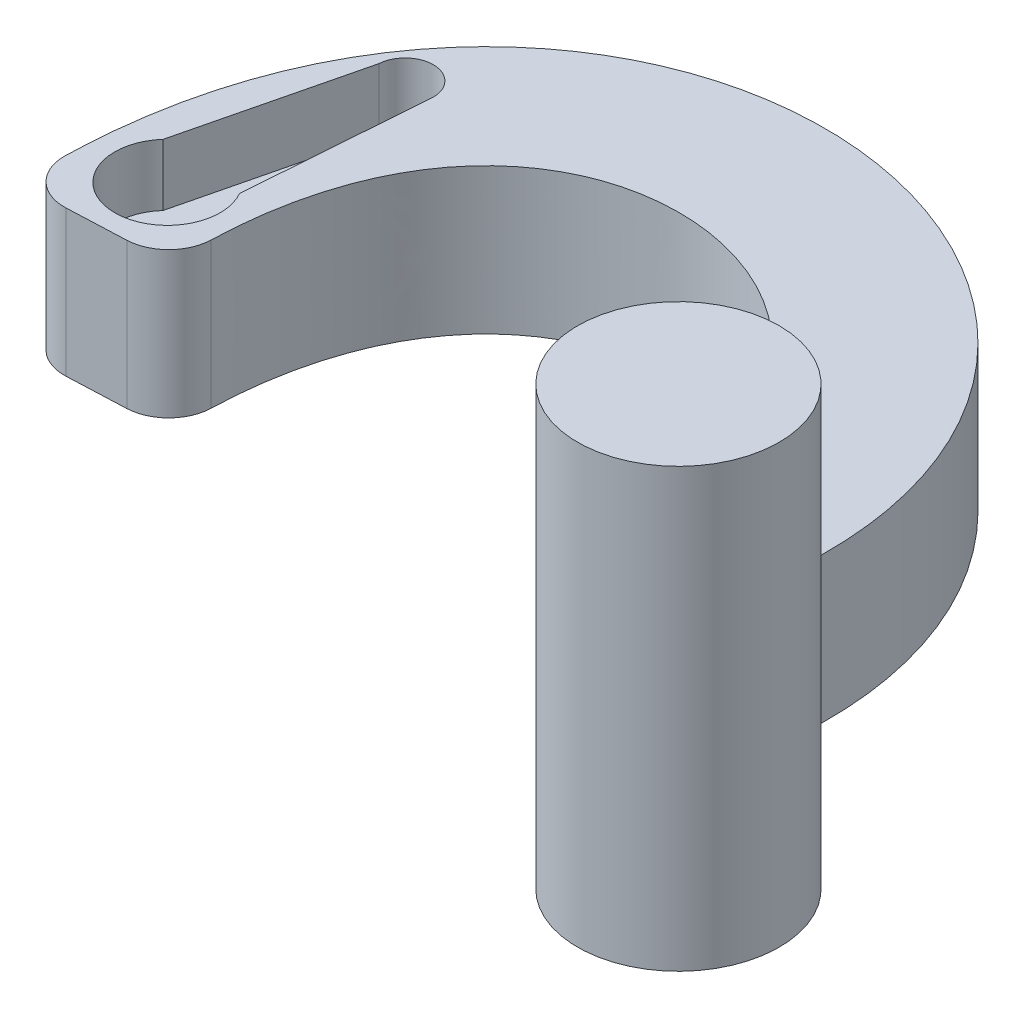
ISO-10303-21;
HEADER;
FILE_DESCRIPTION(('STEP AP214'),'2;1');
FILE_NAME('part.step','',(''),(''),'','','');
FILE_SCHEMA(('AUTOMOTIVE_DESIGN { 1 0 10303 214 1 1 1 1 }'));
ENDSEC;
DATA;
#1=APPLICATION_CONTEXT('core data for automotive mechanical design processes');
#2=APPLICATION_PROTOCOL_DEFINITION('international standard','automotive_design',2000,#1);
#3=PRODUCT_CONTEXT('',#1,'mechanical');
#4=PRODUCT('Part','Part','',(#3));
#5=PRODUCT_RELATED_PRODUCT_CATEGORY('part','',(#4));
#6=PRODUCT_DEFINITION_FORMATION('','',#4);
#7=PRODUCT_DEFINITION_CONTEXT('part definition',#1,'design');
#8=PRODUCT_DEFINITION('design','',#6,#7);
#9=PRODUCT_DEFINITION_SHAPE('','',#8);
#10=(LENGTH_UNIT() NAMED_UNIT(*) SI_UNIT(.MILLI.,.METRE.));
#11=(NAMED_UNIT(*) PLANE_ANGLE_UNIT() SI_UNIT($,.RADIAN.));
#12=(NAMED_UNIT(*) SI_UNIT($,.STERADIAN.) SOLID_ANGLE_UNIT());
#13=UNCERTAINTY_MEASURE_WITH_UNIT(LENGTH_MEASURE(1.E-05),#10,'distance_accuracy_value','');
#14=(GEOMETRIC_REPRESENTATION_CONTEXT(3) GLOBAL_UNCERTAINTY_ASSIGNED_CONTEXT((#13)) GLOBAL_UNIT_ASSIGNED_CONTEXT((#10,
#11,#12)) REPRESENTATION_CONTEXT('',''));
#15=CARTESIAN_POINT('',(0.,0.,0.));
#16=DIRECTION('',(0.,0.,1.));
#17=DIRECTION('',(1.,0.,0.));
#18=AXIS2_PLACEMENT_3D('',#15,#16,#17);
#19=CARTESIAN_POINT('',(7.64062472290803,10.,-41.6799879105812));
#20=DIRECTION('',(0.,-1.,0.));
#21=DIRECTION('',(-1.,0.,0.));
#22=AXIS2_PLACEMENT_3D('',#19,#20,#21);
#23=PLANE('',#22);
#24=CARTESIAN_POINT('',(32.7867271292734,10.,-16.1855995947889));
#25=CARTESIAN_POINT('',(32.8119604341998,10.,-18.0482852177908));
#26=CARTESIAN_POINT('',(32.6410157246207,10.,-19.8796153593314));
#27=CARTESIAN_POINT('',(31.9297026696758,10.,-23.4023587957538));
#28=CARTESIAN_POINT('',(31.389692112877,10.,-25.0928475649463));
#29=CARTESIAN_POINT('',(29.9962645290395,10.,-28.2655539081912));
#30=CARTESIAN_POINT('',(29.1436477948738,10.,-29.7475648330569));
#31=CARTESIAN_POINT('',(27.1952842098645,10.,-32.4648684794221));
#32=CARTESIAN_POINT('',(26.1000398728155,10.,-33.7005720082806));
#33=CARTESIAN_POINT('',(23.728981301755,10.,-35.9124711043768));
#34=CARTESIAN_POINT('',(22.4532211714971,10.,-36.8891668948954));
#35=CARTESIAN_POINT('',(19.767583781485,10.,-38.580346198244));
#36=CARTESIAN_POINT('',(18.3575137063876,10.,-39.295168946829));
#37=CARTESIAN_POINT('',(15.4364869316384,10.,-40.4567383093665));
#38=CARTESIAN_POINT('',(13.9252204877264,10.,-40.9036533797302));
#39=CARTESIAN_POINT('',(10.8297033006953,10.,-41.5127930644092));
#40=CARTESIAN_POINT('',(9.24503255547907,10.,-41.6749912434509));
#41=CARTESIAN_POINT('',(6.03621689033693,10.,-41.6849845777115));
#42=CARTESIAN_POINT('',(4.41160875488499,10.,-41.532400862902));
#43=CARTESIAN_POINT('',(1.17578059459176,10.,-40.8753806550135));
#44=CARTESIAN_POINT('',(-0.435544855269906,10.,-40.3701073052131));
#45=CARTESIAN_POINT('',(-3.56207624680433,10.,-38.980716277114));
#46=CARTESIAN_POINT('',(-5.07644898219667,10.,-38.0958422566122));
#47=CARTESIAN_POINT('',(-7.90552566302367,10.,-35.9576561356316));
#48=CARTESIAN_POINT('',(-9.2188575846229,10.,-34.7047592040743));
#49=CARTESIAN_POINT('',(-11.557755339762,10.,-31.887270707591));
#50=CARTESIAN_POINT('',(-12.5829006423501,10.,-30.3240851759072));
#51=CARTESIAN_POINT('',(-14.3051774786087,10.,-26.9589991969778));
#52=CARTESIAN_POINT('',(-15.0030876470042,10.,-25.1579773853439));
#53=CARTESIAN_POINT('',(-16.0720491374155,10.,-21.3665525397625));
#54=CARTESIAN_POINT('',(-16.4439595922735,10.,-19.3760411307585));
#55=CARTESIAN_POINT('',(-16.8745791436573,10.,-15.2195573111969));
#56=CARTESIAN_POINT('',(-16.9336520104563,10.,-13.0531209713478));
#57=CARTESIAN_POINT('',(-16.8393758778375,10.,-10.7937998573511));
#58=B_SPLINE_CURVE_WITH_KNOTS('',3,(#24,#25,#26,#27,#28,#29,#30,#31,#32,#33,#34,#35,#36,#37,#38,
#39,#40,#41,#42,#43,#44,#45,#46,#47,#48,#49,#50,#51,#52,#53,#54,#55,#56,#57),.UNSPECIFIED.,.F.,
.F.,(4,2,2,2,2,2,2,2,2,2,2,2,2,2,2,2,4),(0.,0.0625000000000001,0.125,0.1875,0.25,0.3125,0.375,
0.4375,0.5,0.5625,0.625000000000001,0.687500000000001,0.750000000000001,0.8125,0.875,0.9375,1.),.UNSPECIFIED.);
#59=CARTESIAN_POINT('',(32.7867271292734,10.,-16.1855995947889));
#60=VERTEX_POINT('',#59);
#61=CARTESIAN_POINT('',(-16.8685310593554,10.,-13.995153533089));
#62=VERTEX_POINT('',#61);
#63=EDGE_CURVE('E168',#60,#62,#58,.T.);
#64=ORIENTED_EDGE('',*,*,#63,.T.);
#65=CARTESIAN_POINT('',(-13.8694641005101,10.,-13.9203379173208));
#66=DIRECTION('',(0.,-1.,0.));
#67=DIRECTION('',(0.,0.,-1.));
#68=AXIS2_PLACEMENT_3D('',#65,#66,#67);
#69=CIRCLE('',#68,3.);
#70=CARTESIAN_POINT('',(-13.7443900296354,10.,-10.9229463051361));
#71=VERTEX_POINT('',#70);
#72=EDGE_CURVE('E48',#62,#71,#69,.F.);
#73=ORIENTED_EDGE('',*,*,#72,.T.);
#74=DIRECTION('',(-0.999130537394879,0.,0.0416913569582492));
#75=VECTOR('',#74,1.);
#76=CARTESIAN_POINT('',(-6.84807050388869,10.,-11.2107134269335));
#77=LINE('',#76,#75);
#78=CARTESIAN_POINT('',(-9.73794768174787,10.,-11.0901256794088));
#79=VERTEX_POINT('',#78);
#80=EDGE_CURVE('E175',#79,#71,#77,.T.);
#81=ORIENTED_EDGE('',*,*,#80,.F.);
#82=CARTESIAN_POINT('',(-9.86302175262262,10.,-14.0875172915935));
#83=DIRECTION('',(0.,-1.,0.));
#84=DIRECTION('',(0.,0.,-1.));
#85=AXIS2_PLACEMENT_3D('',#82,#83,#84);
#86=CIRCLE('',#85,3.);
#87=CARTESIAN_POINT('',(-6.86455786139781,10.,-13.9915261825208));
#88=VERTEX_POINT('',#87);
#89=EDGE_CURVE('E63',#79,#88,#86,.F.);
#90=ORIENTED_EDGE('',*,*,#89,.T.);
#91=CARTESIAN_POINT('',(22.7876445728867,10.,-16.3210544971157));
#92=CARTESIAN_POINT('',(23.0407058865293,10.,-35.0016701372489));
#93=CARTESIAN_POINT('',(-8.06194657324363,10.,-40.3011709699666));
#94=CARTESIAN_POINT('',(-6.84807050388869,10.,-11.2107134269335));
#95=B_SPLINE_CURVE_WITH_KNOTS('',3,(#91,#92,#93,#94),.UNSPECIFIED.,.F.,.F.,(4,4),(0.,1.),.UNSPECIFIED.);
#96=CARTESIAN_POINT('',(22.7876445728867,10.,-16.3210544971157));
#97=VERTEX_POINT('',#96);
#98=EDGE_CURVE('E216',#97,#88,#95,.T.);
#99=ORIENTED_EDGE('',*,*,#98,.F.);
#100=CARTESIAN_POINT('',(27.722370722819,10.,-11.4687691801821));
#101=DIRECTION('',(0.,-1.,0.));
#102=DIRECTION('',(0.,0.,-1.));
#103=AXIS2_PLACEMENT_3D('',#100,#101,#102);
#104=CIRCLE('',#103,6.92070769298594);
#105=EDGE_CURVE('E148',#97,#60,#104,.T.);
#106=ORIENTED_EDGE('',*,*,#105,.T.);
#107=EDGE_LOOP('',(#64,#73,#81,#90,#99,#106));
#108=FACE_BOUND('',#107,.T.);
#109=CARTESIAN_POINT('',(-11.7849751470021,10.,-15.9248017046449));
#110=DIRECTION('',(0.,-1.,0.));
#111=DIRECTION('',(0.,0.,-1.));
#112=AXIS2_PLACEMENT_3D('',#109,#110,#111);
#113=CIRCLE('',#112,3.6195);
#114=CARTESIAN_POINT('',(-8.64951612523121,10.,-17.7330265172153));
#115=VERTEX_POINT('',#114);
#116=CARTESIAN_POINT('',(-14.488068718964,10.,-18.3318881989816));
#117=VERTEX_POINT('',#116);
#118=EDGE_CURVE('E55',#115,#117,#113,.T.);
#119=ORIENTED_EDGE('',*,*,#118,.T.);
#120=DIRECTION('',(0.237100117350606,0.,-0.971485220861506));
#121=VECTOR('',#120,1.);
#122=CARTESIAN_POINT('',(-11.5844700898957,10.,-30.2289854546631));
#123=LINE('',#122,#121);
#124=CARTESIAN_POINT('',(-11.5844700898957,10.,-30.2289854546631));
#125=VERTEX_POINT('',#124);
#126=EDGE_CURVE('E140',#117,#125,#123,.T.);
#127=ORIENTED_EDGE('',*,*,#126,.T.);
#128=CARTESIAN_POINT('',(-9.65822953295707,10.,-30.1023305029049));
#129=DIRECTION('',(0.,-1.,0.));
#130=DIRECTION('',(0.,0.,-1.));
#131=AXIS2_PLACEMENT_3D('',#128,#129,#130);
#132=CIRCLE('',#131,1.9304);
#133=CARTESIAN_POINT('',(-7.73875692944453,10.,-29.8972230082471));
#134=VERTEX_POINT('',#133);
#135=EDGE_CURVE('E335',#125,#134,#132,.T.);
#136=ORIENTED_EDGE('',*,*,#135,.T.);
#137=DIRECTION('',(-0.0746631392163496,0.,0.997208812457231));
#138=VECTOR('',#137,1.);
#139=CARTESIAN_POINT('',(-8.64951612523121,10.,-17.7330265172153));
#140=LINE('',#139,#138);
#141=EDGE_CURVE('E136',#134,#115,#140,.T.);
#142=ORIENTED_EDGE('',*,*,#141,.T.);
#143=EDGE_LOOP('',(#119,#127,#136,#142));
#144=FACE_BOUND('',#143,.T.);
#145=ADVANCED_FACE('F39',(#108,#144),#23,.F.);
#146=DIRECTION('',(0.,-1.,0.));
#147=VECTOR('',#146,1.);
#148=SURFACE_OF_LINEAR_EXTRUSION('',#58,#147);
#149=CARTESIAN_POINT('',(32.7867271292734,0.,-16.1855995947889));
#150=CARTESIAN_POINT('',(32.8119604341998,0.,-18.0482852177908));
#151=CARTESIAN_POINT('',(32.6410157246207,0.,-19.8796153593314));
#152=CARTESIAN_POINT('',(31.9297026696758,0.,-23.4023587957538));
#153=CARTESIAN_POINT('',(31.389692112877,0.,-25.0928475649463));
#154=CARTESIAN_POINT('',(29.9962645290395,0.,-28.2655539081912));
#155=CARTESIAN_POINT('',(29.1436477948738,0.,-29.7475648330569));
#156=CARTESIAN_POINT('',(27.1952842098645,0.,-32.4648684794221));
#157=CARTESIAN_POINT('',(26.1000398728155,0.,-33.7005720082806));
#158=CARTESIAN_POINT('',(23.728981301755,0.,-35.9124711043768));
#159=CARTESIAN_POINT('',(22.4532211714971,0.,-36.8891668948954));
#160=CARTESIAN_POINT('',(19.767583781485,0.,-38.580346198244));
#161=CARTESIAN_POINT('',(18.3575137063876,0.,-39.295168946829));
#162=CARTESIAN_POINT('',(15.4364869316384,0.,-40.4567383093665));
#163=CARTESIAN_POINT('',(13.9252204877264,0.,-40.9036533797302));
#164=CARTESIAN_POINT('',(10.8297033006953,0.,-41.5127930644092));
#165=CARTESIAN_POINT('',(9.24503255547907,0.,-41.6749912434509));
#166=CARTESIAN_POINT('',(6.03621689033693,0.,-41.6849845777115));
#167=CARTESIAN_POINT('',(4.41160875488499,0.,-41.532400862902));
#168=CARTESIAN_POINT('',(1.17578059459176,0.,-40.8753806550135));
#169=CARTESIAN_POINT('',(-0.435544855269906,0.,-40.3701073052131));
#170=CARTESIAN_POINT('',(-3.56207624680433,0.,-38.980716277114));
#171=CARTESIAN_POINT('',(-5.07644898219667,0.,-38.0958422566122));
#172=CARTESIAN_POINT('',(-7.90552566302367,0.,-35.9576561356316));
#173=CARTESIAN_POINT('',(-9.2188575846229,0.,-34.7047592040743));
#174=CARTESIAN_POINT('',(-11.557755339762,0.,-31.887270707591));
#175=CARTESIAN_POINT('',(-12.5829006423501,0.,-30.3240851759072));
#176=CARTESIAN_POINT('',(-14.3051774786087,0.,-26.9589991969778));
#177=CARTESIAN_POINT('',(-15.0030876470042,0.,-25.1579773853439));
#178=CARTESIAN_POINT('',(-16.0720491374155,0.,-21.3665525397625));
#179=CARTESIAN_POINT('',(-16.4439595922735,0.,-19.3760411307585));
#180=CARTESIAN_POINT('',(-16.8745791436573,0.,-15.2195573111969));
#181=CARTESIAN_POINT('',(-16.9336520104563,0.,-13.0531209713478));
#182=CARTESIAN_POINT('',(-16.8393758778375,0.,-10.7937998573511));
#183=B_SPLINE_CURVE_WITH_KNOTS('',3,(#149,#150,#151,#152,#153,#154,#155,#156,#157,#158,#159,
#160,#161,#162,#163,#164,#165,#166,#167,#168,#169,#170,#171,#172,#173,#174,#175,#176,#177,#178,
#179,#180,#181,#182),.UNSPECIFIED.,.F.,.F.,(4,2,2,2,2,2,2,2,2,2,2,2,2,2,2,2,4),(0.,
0.0625000000000001,0.125,0.1875,0.25,0.3125,0.375,0.4375,0.5,0.5625,0.625000000000001,
0.687500000000001,0.750000000000001,0.8125,0.875,0.9375,1.),.UNSPECIFIED.);
#184=CARTESIAN_POINT('',(32.7867271292734,0.,-16.1855995947889));
#185=VERTEX_POINT('',#184);
#186=CARTESIAN_POINT('',(-16.8685310593554,0.,-13.995153533089));
#187=VERTEX_POINT('',#186);
#188=EDGE_CURVE('E161',#185,#187,#183,.T.);
#189=ORIENTED_EDGE('',*,*,#188,.T.);
#190=DIRECTION('',(0.,-1.,0.));
#191=VECTOR('',#190,1.);
#192=CARTESIAN_POINT('',(-16.8685310593554,0.,-13.995153533089));
#193=LINE('',#192,#191);
#194=EDGE_CURVE('E263',#187,#62,#193,.F.);
#195=ORIENTED_EDGE('',*,*,#194,.T.);
#196=ORIENTED_EDGE('',*,*,#63,.F.);
#197=DIRECTION('',(0.,-1.,0.));
#198=VECTOR('',#197,1.);
#199=CARTESIAN_POINT('',(32.7867271292734,10.,-16.1855995947889));
#200=LINE('',#199,#198);
#201=EDGE_CURVE('E222',#60,#185,#200,.T.);
#202=ORIENTED_EDGE('',*,*,#201,.T.);
#203=EDGE_LOOP('',(#189,#195,#196,#202));
#204=FACE_BOUND('',#203,.T.);
#205=ADVANCED_FACE('F182',(#204),#148,.F.);
#206=CARTESIAN_POINT('',(-6.84807050388869,10.,-11.2107134269335));
#207=DIRECTION('',(0.0416913569582492,0.,0.999130537394879));
#208=DIRECTION('',(0.999130537394879,0.,-0.0416913569582492));
#209=AXIS2_PLACEMENT_3D('',#206,#207,#208);
#210=PLANE('',#209);
#211=ORIENTED_EDGE('',*,*,#80,.T.);
#212=DIRECTION('',(0.,1.,0.));
#213=VECTOR('',#212,1.);
#214=CARTESIAN_POINT('',(-13.7443900296354,0.,-10.9229463051361));
#215=LINE('',#214,#213);
#216=CARTESIAN_POINT('',(-13.7443900296354,0.,-10.9229463051361));
#217=VERTEX_POINT('',#216);
#218=EDGE_CURVE('E253',#71,#217,#215,.F.);
#219=ORIENTED_EDGE('',*,*,#218,.T.);
#220=DIRECTION('',(-0.999130537394879,0.,0.0416913569582492));
#221=VECTOR('',#220,1.);
#222=CARTESIAN_POINT('',(-6.84807050388869,0.,-11.2107134269335));
#223=LINE('',#222,#221);
#224=CARTESIAN_POINT('',(-9.73794768174787,0.,-11.0901256794088));
#225=VERTEX_POINT('',#224);
#226=EDGE_CURVE('E231',#225,#217,#223,.T.);
#227=ORIENTED_EDGE('',*,*,#226,.F.);
#228=DIRECTION('',(0.,-1.,0.));
#229=VECTOR('',#228,1.);
#230=CARTESIAN_POINT('',(-9.73794768174787,10.,-11.0901256794088));
#231=LINE('',#230,#229);
#232=EDGE_CURVE('E166',#225,#79,#231,.F.);
#233=ORIENTED_EDGE('',*,*,#232,.T.);
#234=EDGE_LOOP('',(#211,#219,#227,#233));
#235=FACE_BOUND('',#234,.T.);
#236=ADVANCED_FACE('F185',(#235),#210,.T.);
#237=DIRECTION('',(0.,-1.,0.));
#238=VECTOR('',#237,1.);
#239=SURFACE_OF_LINEAR_EXTRUSION('',#95,#238);
#240=ORIENTED_EDGE('',*,*,#98,.T.);
#241=DIRECTION('',(0.,-1.,0.));
#242=VECTOR('',#241,1.);
#243=CARTESIAN_POINT('',(-6.86455786139781,10.,-13.9915261825208));
#244=LINE('',#243,#242);
#245=CARTESIAN_POINT('',(-6.86455786139781,0.,-13.9915261825208));
#246=VERTEX_POINT('',#245);
#247=EDGE_CURVE('E11',#88,#246,#244,.T.);
#248=ORIENTED_EDGE('',*,*,#247,.T.);
#249=CARTESIAN_POINT('',(22.7876445728867,0.,-16.3210544971157));
#250=CARTESIAN_POINT('',(23.0407058865293,0.,-35.0016701372489));
#251=CARTESIAN_POINT('',(-8.06194657324363,0.,-40.3011709699666));
#252=CARTESIAN_POINT('',(-6.84807050388869,0.,-11.2107134269335));
#253=B_SPLINE_CURVE_WITH_KNOTS('',3,(#249,#250,#251,#252),.UNSPECIFIED.,.F.,.F.,(4,4),(0.,1.),.UNSPECIFIED.);
#254=CARTESIAN_POINT('',(22.7876445728867,0.,-16.3210544971157));
#255=VERTEX_POINT('',#254);
#256=EDGE_CURVE('E176',#255,#246,#253,.T.);
#257=ORIENTED_EDGE('',*,*,#256,.F.);
#258=DIRECTION('',(0.,-1.,0.));
#259=VECTOR('',#258,1.);
#260=CARTESIAN_POINT('',(22.7876445728867,10.,-16.3210544971157));
#261=LINE('',#260,#259);
#262=EDGE_CURVE('E167',#97,#255,#261,.T.);
#263=ORIENTED_EDGE('',*,*,#262,.F.);
#264=EDGE_LOOP('',(#240,#248,#257,#263));
#265=FACE_BOUND('',#264,.T.);
#266=ADVANCED_FACE('F212',(#265),#239,.T.);
#267=CARTESIAN_POINT('',(7.64062472290803,0.,-41.6799879105812));
#268=DIRECTION('',(0.,-1.,0.));
#269=DIRECTION('',(-1.,0.,0.));
#270=AXIS2_PLACEMENT_3D('',#267,#268,#269);
#271=PLANE('',#270);
#272=CARTESIAN_POINT('',(-11.7849751470021,0.,-15.9248017046449));
#273=DIRECTION('',(0.,-1.,0.));
#274=DIRECTION('',(0.,0.,-1.));
#275=AXIS2_PLACEMENT_3D('',#272,#273,#274);
#276=CIRCLE('',#275,1.);
#277=CARTESIAN_POINT('',(-11.7849751470021,0.,-16.9248017046449));
#278=VERTEX_POINT('',#277);
#279=EDGE_CURVE('E317',#278,#278,#276,.T.);
#280=ORIENTED_EDGE('',*,*,#279,.F.);
#281=EDGE_LOOP('',(#280));
#282=FACE_BOUND('',#281,.T.);
#283=ORIENTED_EDGE('',*,*,#226,.T.);
#284=CARTESIAN_POINT('',(-13.8694641005101,0.,-13.9203379173208));
#285=DIRECTION('',(0.,-1.,0.));
#286=DIRECTION('',(0.,0.,-1.));
#287=AXIS2_PLACEMENT_3D('',#284,#285,#286);
#288=CIRCLE('',#287,3.);
#289=EDGE_CURVE('E260',#217,#187,#288,.T.);
#290=ORIENTED_EDGE('',*,*,#289,.T.);
#291=ORIENTED_EDGE('',*,*,#188,.F.);
#292=CARTESIAN_POINT('',(27.722370722819,0.,-11.4687691801821));
#293=DIRECTION('',(0.,-1.,0.));
#294=DIRECTION('',(0.,0.,-1.));
#295=AXIS2_PLACEMENT_3D('',#292,#293,#294);
#296=CIRCLE('',#295,6.92070769298594);
#297=EDGE_CURVE('E162',#255,#185,#296,.T.);
#298=ORIENTED_EDGE('',*,*,#297,.F.);
#299=ORIENTED_EDGE('',*,*,#256,.T.);
#300=CARTESIAN_POINT('',(-9.86302175262262,0.,-14.0875172915935));
#301=DIRECTION('',(0.,-1.,0.));
#302=DIRECTION('',(0.,0.,-1.));
#303=AXIS2_PLACEMENT_3D('',#300,#301,#302);
#304=CIRCLE('',#303,3.);
#305=EDGE_CURVE('E257',#246,#225,#304,.T.);
#306=ORIENTED_EDGE('',*,*,#305,.T.);
#307=EDGE_LOOP('',(#283,#290,#291,#298,#299,#306));
#308=FACE_BOUND('',#307,.T.);
#309=ADVANCED_FACE('F210',(#282,#308),#271,.T.);
#310=CARTESIAN_POINT('',(27.722370722819,-10.,-11.4687691801821));
#311=DIRECTION('',(0.,1.,0.));
#312=DIRECTION('',(0.,0.,1.));
#313=AXIS2_PLACEMENT_3D('',#310,#311,#312);
#314=CYLINDRICAL_SURFACE('',#313,6.92070769298594);
#315=CARTESIAN_POINT('',(27.722370722819,-10.,-11.4687691801821));
#316=DIRECTION('',(0.,-1.,0.));
#317=DIRECTION('',(0.,0.,-1.));
#318=AXIS2_PLACEMENT_3D('',#315,#316,#317);
#319=CIRCLE('',#318,6.92070769298594);
#320=CARTESIAN_POINT('',(27.722370722819,-10.,-18.3894768731681));
#321=VERTEX_POINT('',#320);
#322=EDGE_CURVE('E157',#321,#321,#319,.T.);
#323=ORIENTED_EDGE('',*,*,#322,.F.);
#324=EDGE_LOOP('',(#323));
#325=FACE_BOUND('',#324,.T.);
#326=ORIENTED_EDGE('',*,*,#297,.T.);
#327=ORIENTED_EDGE('',*,*,#201,.F.);
#328=ORIENTED_EDGE('',*,*,#105,.F.);
#329=ORIENTED_EDGE('',*,*,#262,.T.);
#330=EDGE_LOOP('',(#326,#327,#328,#329));
#331=FACE_BOUND('',#330,.T.);
#332=CARTESIAN_POINT('',(27.722370722819,20.,-11.4687691801821));
#333=DIRECTION('',(0.,-1.,0.));
#334=DIRECTION('',(0.,0.,-1.));
#335=AXIS2_PLACEMENT_3D('',#332,#333,#334);
#336=CIRCLE('',#335,6.92070769298594);
#337=CARTESIAN_POINT('',(27.722370722819,20.,-18.3894768731681));
#338=VERTEX_POINT('',#337);
#339=EDGE_CURVE('E142',#338,#338,#336,.T.);
#340=ORIENTED_EDGE('',*,*,#339,.T.);
#341=EDGE_LOOP('',(#340));
#342=FACE_BOUND('',#341,.T.);
#343=ADVANCED_FACE('F208',(#325,#331,#342),#314,.T.);
#344=CARTESIAN_POINT('',(27.722370722819,-10.,-11.4687691801821));
#345=DIRECTION('',(0.,-1.,0.));
#346=DIRECTION('',(0.,0.,-1.));
#347=AXIS2_PLACEMENT_3D('',#344,#345,#346);
#348=PLANE('',#347);
#349=ORIENTED_EDGE('',*,*,#322,.T.);
#350=EDGE_LOOP('',(#349));
#351=FACE_BOUND('',#350,.T.);
#352=ADVANCED_FACE('F197',(#351),#348,.T.);
#353=CARTESIAN_POINT('',(27.722370722819,20.,-11.4687691801821));
#354=DIRECTION('',(0.,-1.,0.));
#355=DIRECTION('',(0.,0.,-1.));
#356=AXIS2_PLACEMENT_3D('',#353,#354,#355);
#357=PLANE('',#356);
#358=ORIENTED_EDGE('',*,*,#339,.F.);
#359=EDGE_LOOP('',(#358));
#360=FACE_BOUND('',#359,.T.);
#361=ADVANCED_FACE('F190',(#360),#357,.F.);
#362=CARTESIAN_POINT('',(-13.8694641005101,5.,-13.9203379173208));
#363=DIRECTION('',(0.,-1.,0.));
#364=DIRECTION('',(0.,0.,-1.));
#365=AXIS2_PLACEMENT_3D('',#362,#363,#364);
#366=CYLINDRICAL_SURFACE('',#365,3.);
#367=ORIENTED_EDGE('',*,*,#72,.F.);
#368=ORIENTED_EDGE('',*,*,#194,.F.);
#369=ORIENTED_EDGE('',*,*,#289,.F.);
#370=ORIENTED_EDGE('',*,*,#218,.F.);
#371=EDGE_LOOP('',(#367,#368,#369,#370));
#372=FACE_BOUND('',#371,.T.);
#373=ADVANCED_FACE('F188',(#372),#366,.T.);
#374=CARTESIAN_POINT('',(-9.86302175262262,5.,-14.0875172915935));
#375=DIRECTION('',(0.,-1.,0.));
#376=DIRECTION('',(0.,0.,-1.));
#377=AXIS2_PLACEMENT_3D('',#374,#375,#376);
#378=CYLINDRICAL_SURFACE('',#377,3.);
#379=ORIENTED_EDGE('',*,*,#89,.F.);
#380=ORIENTED_EDGE('',*,*,#232,.F.);
#381=ORIENTED_EDGE('',*,*,#305,.F.);
#382=ORIENTED_EDGE('',*,*,#247,.F.);
#383=EDGE_LOOP('',(#379,#380,#381,#382));
#384=FACE_BOUND('',#383,.T.);
#385=ADVANCED_FACE('F41',(#384),#378,.T.);
#386=CARTESIAN_POINT('',(-11.7849751470021,5.7709,-15.9248017046449));
#387=DIRECTION('',(0.,1.,0.));
#388=DIRECTION('',(0.,0.,1.));
#389=AXIS2_PLACEMENT_3D('',#386,#387,#388);
#390=CYLINDRICAL_SURFACE('',#389,3.6195);
#391=ORIENTED_EDGE('',*,*,#118,.F.);
#392=DIRECTION('',(0.,1.,0.));
#393=VECTOR('',#392,1.);
#394=CARTESIAN_POINT('',(-8.64951612523121,5.7709,-17.7330265172153));
#395=LINE('',#394,#393);
#396=CARTESIAN_POINT('',(-8.64951612523121,5.7709,-17.7330265172153));
#397=VERTEX_POINT('',#396);
#398=EDGE_CURVE('E134',#397,#115,#395,.T.);
#399=ORIENTED_EDGE('',*,*,#398,.F.);
#400=CARTESIAN_POINT('',(-11.7849751470021,5.7709,-15.9248017046449));
#401=DIRECTION('',(0.,-1.,0.));
#402=DIRECTION('',(0.,0.,-1.));
#403=AXIS2_PLACEMENT_3D('',#400,#401,#402);
#404=CIRCLE('',#403,3.6195);
#405=CARTESIAN_POINT('',(-14.488068718964,5.7709,-18.3318881989816));
#406=VERTEX_POINT('',#405);
#407=EDGE_CURVE('E125',#397,#406,#404,.T.);
#408=ORIENTED_EDGE('',*,*,#407,.T.);
#409=DIRECTION('',(0.,1.,0.));
#410=VECTOR('',#409,1.);
#411=CARTESIAN_POINT('',(-14.488068718964,5.7709,-18.3318881989816));
#412=LINE('',#411,#410);
#413=EDGE_CURVE('E133',#406,#117,#412,.T.);
#414=ORIENTED_EDGE('',*,*,#413,.T.);
#415=EDGE_LOOP('',(#391,#399,#408,#414));
#416=FACE_BOUND('',#415,.T.);
#417=ADVANCED_FACE('F132',(#416),#390,.F.);
#418=CARTESIAN_POINT('',(-11.5844700898957,5.7709,-30.2289854546631));
#419=DIRECTION('',(0.971485220861506,0.,0.237100117350606));
#420=DIRECTION('',(0.237100117350606,0.,-0.971485220861506));
#421=AXIS2_PLACEMENT_3D('',#418,#419,#420);
#422=PLANE('',#421);
#423=ORIENTED_EDGE('',*,*,#126,.F.);
#424=ORIENTED_EDGE('',*,*,#413,.F.);
#425=DIRECTION('',(0.237100117350606,0.,-0.971485220861506));
#426=VECTOR('',#425,1.);
#427=CARTESIAN_POINT('',(-11.5844700898957,5.7709,-30.2289854546631));
#428=LINE('',#427,#426);
#429=CARTESIAN_POINT('',(-11.5844700898957,5.7709,-30.2289854546631));
#430=VERTEX_POINT('',#429);
#431=EDGE_CURVE('E121',#406,#430,#428,.T.);
#432=ORIENTED_EDGE('',*,*,#431,.T.);
#433=DIRECTION('',(0.,1.,0.));
#434=VECTOR('',#433,1.);
#435=CARTESIAN_POINT('',(-11.5844700898957,5.7709,-30.2289854546631));
#436=LINE('',#435,#434);
#437=EDGE_CURVE('E143',#430,#125,#436,.T.);
#438=ORIENTED_EDGE('',*,*,#437,.T.);
#439=EDGE_LOOP('',(#423,#424,#432,#438));
#440=FACE_BOUND('',#439,.T.);
#441=ADVANCED_FACE('F138',(#440),#422,.T.);
#442=CARTESIAN_POINT('',(-9.65822953295707,5.7709,-30.1023305029049));
#443=DIRECTION('',(0.,1.,0.));
#444=DIRECTION('',(0.,0.,1.));
#445=AXIS2_PLACEMENT_3D('',#442,#443,#444);
#446=CYLINDRICAL_SURFACE('',#445,1.9304);
#447=ORIENTED_EDGE('',*,*,#135,.F.);
#448=ORIENTED_EDGE('',*,*,#437,.F.);
#449=CARTESIAN_POINT('',(-9.65822953295707,5.7709,-30.1023305029049));
#450=DIRECTION('',(0.,-1.,0.));
#451=DIRECTION('',(0.,0.,-1.));
#452=AXIS2_PLACEMENT_3D('',#449,#450,#451);
#453=CIRCLE('',#452,1.9304);
#454=CARTESIAN_POINT('',(-7.73875692944453,5.7709,-29.8972230082471));
#455=VERTEX_POINT('',#454);
#456=EDGE_CURVE('E126',#430,#455,#453,.T.);
#457=ORIENTED_EDGE('',*,*,#456,.T.);
#458=DIRECTION('',(0.,1.,0.));
#459=VECTOR('',#458,1.);
#460=CARTESIAN_POINT('',(-7.73875692944453,5.7709,-29.8972230082471));
#461=LINE('',#460,#459);
#462=EDGE_CURVE('E150',#455,#134,#461,.T.);
#463=ORIENTED_EDGE('',*,*,#462,.T.);
#464=EDGE_LOOP('',(#447,#448,#457,#463));
#465=FACE_BOUND('',#464,.T.);
#466=ADVANCED_FACE('F298',(#465),#446,.F.);
#467=CARTESIAN_POINT('',(-8.64951612523121,5.7709,-17.7330265172153));
#468=DIRECTION('',(-0.997208812457231,0.,-0.0746631392163496));
#469=DIRECTION('',(-0.0746631392163496,0.,0.997208812457231));
#470=AXIS2_PLACEMENT_3D('',#467,#468,#469);
#471=PLANE('',#470);
#472=ORIENTED_EDGE('',*,*,#141,.F.);
#473=ORIENTED_EDGE('',*,*,#462,.F.);
#474=DIRECTION('',(-0.0746631392163496,0.,0.997208812457231));
#475=VECTOR('',#474,1.);
#476=CARTESIAN_POINT('',(-8.64951612523121,5.7709,-17.7330265172153));
#477=LINE('',#476,#475);
#478=EDGE_CURVE('E328',#455,#397,#477,.T.);
#479=ORIENTED_EDGE('',*,*,#478,.T.);
#480=ORIENTED_EDGE('',*,*,#398,.T.);
#481=EDGE_LOOP('',(#472,#473,#479,#480));
#482=FACE_BOUND('',#481,.T.);
#483=ADVANCED_FACE('F301',(#482),#471,.T.);
#484=CARTESIAN_POINT('',(-11.7849751470021,5.7709,-15.9248017046449));
#485=DIRECTION('',(0.,-1.,0.));
#486=DIRECTION('',(0.,0.,-1.));
#487=AXIS2_PLACEMENT_3D('',#484,#485,#486);
#488=PLANE('',#487);
#489=CARTESIAN_POINT('',(-11.7849751470021,5.7709,-15.9248017046449));
#490=DIRECTION('',(0.,1.,0.));
#491=DIRECTION('',(0.,0.,1.));
#492=AXIS2_PLACEMENT_3D('',#489,#490,#491);
#493=CIRCLE('',#492,1.);
#494=CARTESIAN_POINT('',(-11.7849751470021,5.7709,-14.9248017046449));
#495=VERTEX_POINT('',#494);
#496=EDGE_CURVE('E320',#495,#495,#493,.T.);
#497=ORIENTED_EDGE('',*,*,#496,.F.);
#498=EDGE_LOOP('',(#497));
#499=FACE_BOUND('',#498,.T.);
#500=ORIENTED_EDGE('',*,*,#407,.F.);
#501=ORIENTED_EDGE('',*,*,#478,.F.);
#502=ORIENTED_EDGE('',*,*,#456,.F.);
#503=ORIENTED_EDGE('',*,*,#431,.F.);
#504=EDGE_LOOP('',(#500,#501,#502,#503));
#505=FACE_BOUND('',#504,.T.);
#506=ADVANCED_FACE('F123',(#499,#505),#488,.F.);
#507=CARTESIAN_POINT('',(-11.7849751470021,-4.2291,-15.9248017046449));
#508=DIRECTION('',(0.,1.,0.));
#509=DIRECTION('',(0.,0.,1.));
#510=AXIS2_PLACEMENT_3D('',#507,#508,#509);
#511=CYLINDRICAL_SURFACE('',#510,1.);
#512=ORIENTED_EDGE('',*,*,#279,.T.);
#513=EDGE_LOOP('',(#512));
#514=FACE_BOUND('',#513,.T.);
#515=ORIENTED_EDGE('',*,*,#496,.T.);
#516=EDGE_LOOP('',(#515));
#517=FACE_BOUND('',#516,.T.);
#518=ADVANCED_FACE('F308',(#514,#517),#511,.F.);
#519=CLOSED_SHELL('',(#145,#205,#236,#266,#309,#343,#352,#361,#373,#385,#417,#441,#466,#483,
#506,#518));
#520=MANIFOLD_SOLID_BREP('B2',#519);
#521=ADVANCED_BREP_SHAPE_REPRESENTATION('',(#18,#520),#14);
#522=SHAPE_DEFINITION_REPRESENTATION(#9,#521);
ENDSEC;
END-ISO-10303-21;
